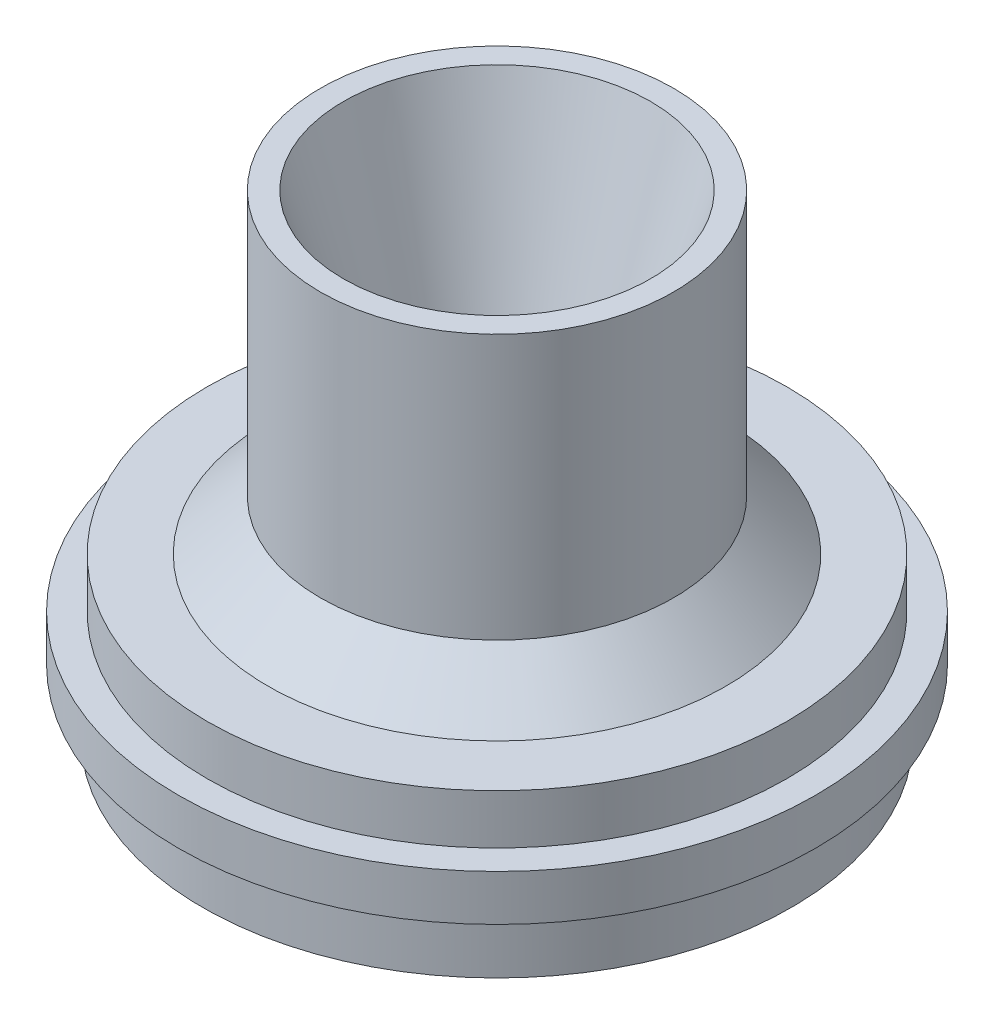
ISO-10303-21;
HEADER;
FILE_DESCRIPTION(('STEP AP214'),'2;1');
FILE_NAME('part.step','',(''),(''),'','','');
FILE_SCHEMA(('AUTOMOTIVE_DESIGN { 1 0 10303 214 1 1 1 1 }'));
ENDSEC;
DATA;
#1=APPLICATION_CONTEXT('core data for automotive mechanical design processes');
#2=APPLICATION_PROTOCOL_DEFINITION('international standard','automotive_design',2000,#1);
#3=PRODUCT_CONTEXT('',#1,'mechanical');
#4=PRODUCT('Part','Part','',(#3));
#5=PRODUCT_RELATED_PRODUCT_CATEGORY('part','',(#4));
#6=PRODUCT_DEFINITION_FORMATION('','',#4);
#7=PRODUCT_DEFINITION_CONTEXT('part definition',#1,'design');
#8=PRODUCT_DEFINITION('design','',#6,#7);
#9=PRODUCT_DEFINITION_SHAPE('','',#8);
#10=(LENGTH_UNIT() NAMED_UNIT(*) SI_UNIT(.MILLI.,.METRE.));
#11=(NAMED_UNIT(*) PLANE_ANGLE_UNIT() SI_UNIT($,.RADIAN.));
#12=(NAMED_UNIT(*) SI_UNIT($,.STERADIAN.) SOLID_ANGLE_UNIT());
#13=UNCERTAINTY_MEASURE_WITH_UNIT(LENGTH_MEASURE(1.E-05),#10,'distance_accuracy_value','');
#14=(GEOMETRIC_REPRESENTATION_CONTEXT(3) GLOBAL_UNCERTAINTY_ASSIGNED_CONTEXT((#13)) GLOBAL_UNIT_ASSIGNED_CONTEXT((#10,
#11,#12)) REPRESENTATION_CONTEXT('',''));
#15=CARTESIAN_POINT('',(0.,0.,0.));
#16=DIRECTION('',(0.,0.,1.));
#17=DIRECTION('',(1.,0.,0.));
#18=AXIS2_PLACEMENT_3D('',#15,#16,#17);
#19=CARTESIAN_POINT('',(0.,0.,0.));
#20=DIRECTION('',(0.,-1.,0.));
#21=DIRECTION('',(0.,0.,-1.));
#22=AXIS2_PLACEMENT_3D('',#19,#20,#21);
#23=CYLINDRICAL_SURFACE('',#22,42.3185589062585);
#24=CARTESIAN_POINT('',(0.,-42.8244,0.));
#25=DIRECTION('',(0.,-1.,0.));
#26=DIRECTION('',(0.,0.,-1.));
#27=AXIS2_PLACEMENT_3D('',#24,#25,#26);
#28=CIRCLE('',#27,42.3185589062585);
#29=CARTESIAN_POINT('',(0.,-42.8244,-42.3185589062585));
#30=VERTEX_POINT('',#29);
#31=EDGE_CURVE('E10',#30,#30,#28,.T.);
#32=ORIENTED_EDGE('',*,*,#31,.F.);
#33=EDGE_LOOP('',(#32));
#34=FACE_BOUND('',#33,.T.);
#35=CARTESIAN_POINT('',(0.,-33.6804,0.));
#36=DIRECTION('',(0.,-1.,0.));
#37=DIRECTION('',(0.,0.,-1.));
#38=AXIS2_PLACEMENT_3D('',#35,#36,#37);
#39=CIRCLE('',#38,42.3185589062585);
#40=CARTESIAN_POINT('',(0.,-33.6804,-42.3185589062585));
#41=VERTEX_POINT('',#40);
#42=EDGE_CURVE('E73',#41,#41,#39,.T.);
#43=ORIENTED_EDGE('',*,*,#42,.T.);
#44=EDGE_LOOP('',(#43));
#45=FACE_BOUND('',#44,.T.);
#46=ADVANCED_FACE('F30',(#34,#45),#23,.T.);
#47=CARTESIAN_POINT('',(-35.0647,-42.8244,0.));
#48=DIRECTION('',(0.,1.,0.));
#49=DIRECTION('',(0.,0.,1.));
#50=AXIS2_PLACEMENT_3D('',#47,#48,#49);
#51=PLANE('',#50);
#52=CARTESIAN_POINT('',(0.,-42.8244,0.));
#53=DIRECTION('',(0.,-1.,0.));
#54=DIRECTION('',(0.,0.,-1.));
#55=AXIS2_PLACEMENT_3D('',#52,#53,#54);
#56=CIRCLE('',#55,35.0647);
#57=CARTESIAN_POINT('',(0.,-42.8244,-35.0647));
#58=VERTEX_POINT('',#57);
#59=EDGE_CURVE('E36',#58,#58,#56,.T.);
#60=ORIENTED_EDGE('',*,*,#59,.F.);
#61=EDGE_LOOP('',(#60));
#62=FACE_BOUND('',#61,.T.);
#63=ORIENTED_EDGE('',*,*,#31,.T.);
#64=EDGE_LOOP('',(#63));
#65=FACE_BOUND('',#64,.T.);
#66=ADVANCED_FACE('F140',(#62,#65),#51,.F.);
#67=CARTESIAN_POINT('',(0.,-42.8244,0.));
#68=DIRECTION('',(0.,-1.,0.));
#69=DIRECTION('',(0.,0.,-1.));
#70=AXIS2_PLACEMENT_3D('',#67,#68,#69);
#71=CONICAL_SURFACE('',#70,35.0647,1.06615947241983);
#72=CARTESIAN_POINT('',(0.,-30.226,0.));
#73=DIRECTION('',(0.,-1.,0.));
#74=DIRECTION('',(0.,0.,-1.));
#75=AXIS2_PLACEMENT_3D('',#72,#73,#74);
#76=CIRCLE('',#75,12.2555);
#77=CARTESIAN_POINT('',(0.,-30.226,-12.2555));
#78=VERTEX_POINT('',#77);
#79=EDGE_CURVE('E40',#78,#78,#76,.T.);
#80=ORIENTED_EDGE('',*,*,#79,.F.);
#81=EDGE_LOOP('',(#80));
#82=FACE_BOUND('',#81,.T.);
#83=ORIENTED_EDGE('',*,*,#59,.T.);
#84=EDGE_LOOP('',(#83));
#85=FACE_BOUND('',#84,.T.);
#86=ADVANCED_FACE('F135',(#82,#85),#71,.F.);
#87=CARTESIAN_POINT('',(0.,0.,0.));
#88=DIRECTION('',(0.,-1.,0.));
#89=DIRECTION('',(0.,0.,-1.));
#90=AXIS2_PLACEMENT_3D('',#87,#88,#89);
#91=CYLINDRICAL_SURFACE('',#90,12.2555);
#92=CARTESIAN_POINT('',(0.,-7.366,0.));
#93=DIRECTION('',(0.,-1.,0.));
#94=DIRECTION('',(0.,0.,-1.));
#95=AXIS2_PLACEMENT_3D('',#92,#93,#94);
#96=CIRCLE('',#95,12.2555);
#97=CARTESIAN_POINT('',(0.,-7.366,-12.2555));
#98=VERTEX_POINT('',#97);
#99=EDGE_CURVE('E44',#98,#98,#96,.T.);
#100=ORIENTED_EDGE('',*,*,#99,.F.);
#101=EDGE_LOOP('',(#100));
#102=FACE_BOUND('',#101,.T.);
#103=ORIENTED_EDGE('',*,*,#79,.T.);
#104=EDGE_LOOP('',(#103));
#105=FACE_BOUND('',#104,.T.);
#106=ADVANCED_FACE('F129',(#102,#105),#91,.F.);
#107=CARTESIAN_POINT('',(0.,-7.366,0.));
#108=DIRECTION('',(0.,1.,0.));
#109=DIRECTION('',(0.,0.,1.));
#110=AXIS2_PLACEMENT_3D('',#107,#108,#109);
#111=CONICAL_SURFACE('',#110,12.2555,0.29181235001844);
#112=CARTESIAN_POINT('',(0.,25.4,0.));
#113=DIRECTION('',(0.,-1.,0.));
#114=DIRECTION('',(0.,0.,-1.));
#115=AXIS2_PLACEMENT_3D('',#112,#113,#114);
#116=CIRCLE('',#115,22.098);
#117=CARTESIAN_POINT('',(0.,25.4,-22.098));
#118=VERTEX_POINT('',#117);
#119=EDGE_CURVE('E49',#118,#118,#116,.T.);
#120=ORIENTED_EDGE('',*,*,#119,.F.);
#121=EDGE_LOOP('',(#120));
#122=FACE_BOUND('',#121,.T.);
#123=ORIENTED_EDGE('',*,*,#99,.T.);
#124=EDGE_LOOP('',(#123));
#125=FACE_BOUND('',#124,.T.);
#126=ADVANCED_FACE('F123',(#122,#125),#111,.F.);
#127=CARTESIAN_POINT('',(-25.4,25.4,0.));
#128=DIRECTION('',(0.,-1.,0.));
#129=DIRECTION('',(0.,0.,-1.));
#130=AXIS2_PLACEMENT_3D('',#127,#128,#129);
#131=PLANE('',#130);
#132=CARTESIAN_POINT('',(0.,25.4,0.));
#133=DIRECTION('',(0.,-1.,0.));
#134=DIRECTION('',(0.,0.,-1.));
#135=AXIS2_PLACEMENT_3D('',#132,#133,#134);
#136=CIRCLE('',#135,25.4);
#137=CARTESIAN_POINT('',(0.,25.4,-25.4));
#138=VERTEX_POINT('',#137);
#139=EDGE_CURVE('E52',#138,#138,#136,.T.);
#140=ORIENTED_EDGE('',*,*,#139,.F.);
#141=EDGE_LOOP('',(#140));
#142=FACE_BOUND('',#141,.T.);
#143=ORIENTED_EDGE('',*,*,#119,.T.);
#144=EDGE_LOOP('',(#143));
#145=FACE_BOUND('',#144,.T.);
#146=ADVANCED_FACE('F117',(#142,#145),#131,.F.);
#147=CARTESIAN_POINT('',(0.,0.,0.));
#148=DIRECTION('',(0.,-1.,0.));
#149=DIRECTION('',(0.,0.,-1.));
#150=AXIS2_PLACEMENT_3D('',#147,#148,#149);
#151=CYLINDRICAL_SURFACE('',#150,25.4);
#152=CARTESIAN_POINT('',(0.,-12.7,0.));
#153=DIRECTION('',(0.,-1.,0.));
#154=DIRECTION('',(0.,0.,-1.));
#155=AXIS2_PLACEMENT_3D('',#152,#153,#154);
#156=CIRCLE('',#155,25.4);
#157=CARTESIAN_POINT('',(0.,-12.7,-25.4));
#158=VERTEX_POINT('',#157);
#159=EDGE_CURVE('E55',#158,#158,#156,.T.);
#160=ORIENTED_EDGE('',*,*,#159,.F.);
#161=EDGE_LOOP('',(#160));
#162=FACE_BOUND('',#161,.T.);
#163=ORIENTED_EDGE('',*,*,#139,.T.);
#164=EDGE_LOOP('',(#163));
#165=FACE_BOUND('',#164,.T.);
#166=ADVANCED_FACE('F111',(#162,#165),#151,.T.);
#167=CARTESIAN_POINT('',(0.,-12.7,0.));
#168=DIRECTION('',(0.,-1.,0.));
#169=DIRECTION('',(0.,0.,-1.));
#170=AXIS2_PLACEMENT_3D('',#167,#168,#169);
#171=CONICAL_SURFACE('',#170,25.4,0.805172026004439);
#172=CARTESIAN_POINT('',(0.,-19.939,0.));
#173=DIRECTION('',(0.,-1.,0.));
#174=DIRECTION('',(0.,0.,-1.));
#175=AXIS2_PLACEMENT_3D('',#172,#173,#174);
#176=CIRCLE('',#175,32.9311);
#177=CARTESIAN_POINT('',(0.,-19.939,-32.9311));
#178=VERTEX_POINT('',#177);
#179=EDGE_CURVE('E58',#178,#178,#176,.T.);
#180=ORIENTED_EDGE('',*,*,#179,.F.);
#181=EDGE_LOOP('',(#180));
#182=FACE_BOUND('',#181,.T.);
#183=ORIENTED_EDGE('',*,*,#159,.T.);
#184=EDGE_LOOP('',(#183));
#185=FACE_BOUND('',#184,.T.);
#186=ADVANCED_FACE('F105',(#182,#185),#171,.T.);
#187=CARTESIAN_POINT('',(-41.6941,-19.939,0.));
#188=DIRECTION('',(0.,-1.,0.));
#189=DIRECTION('',(0.,0.,-1.));
#190=AXIS2_PLACEMENT_3D('',#187,#188,#189);
#191=PLANE('',#190);
#192=CARTESIAN_POINT('',(0.,-19.939,0.));
#193=DIRECTION('',(0.,-1.,0.));
#194=DIRECTION('',(0.,0.,-1.));
#195=AXIS2_PLACEMENT_3D('',#192,#193,#194);
#196=CIRCLE('',#195,41.6941);
#197=CARTESIAN_POINT('',(0.,-19.939,-41.6941));
#198=VERTEX_POINT('',#197);
#199=EDGE_CURVE('E61',#198,#198,#196,.T.);
#200=ORIENTED_EDGE('',*,*,#199,.F.);
#201=EDGE_LOOP('',(#200));
#202=FACE_BOUND('',#201,.T.);
#203=ORIENTED_EDGE('',*,*,#179,.T.);
#204=EDGE_LOOP('',(#203));
#205=FACE_BOUND('',#204,.T.);
#206=ADVANCED_FACE('F99',(#202,#205),#191,.F.);
#207=CARTESIAN_POINT('',(0.,0.,0.));
#208=DIRECTION('',(0.,-1.,0.));
#209=DIRECTION('',(0.,0.,-1.));
#210=AXIS2_PLACEMENT_3D('',#207,#208,#209);
#211=CYLINDRICAL_SURFACE('',#210,41.6941);
#212=CARTESIAN_POINT('',(0.,-27.0764,0.));
#213=DIRECTION('',(0.,-1.,0.));
#214=DIRECTION('',(0.,0.,-1.));
#215=AXIS2_PLACEMENT_3D('',#212,#213,#214);
#216=CIRCLE('',#215,41.6941);
#217=CARTESIAN_POINT('',(0.,-27.0764,-41.6941));
#218=VERTEX_POINT('',#217);
#219=EDGE_CURVE('E64',#218,#218,#216,.T.);
#220=ORIENTED_EDGE('',*,*,#219,.F.);
#221=EDGE_LOOP('',(#220));
#222=FACE_BOUND('',#221,.T.);
#223=ORIENTED_EDGE('',*,*,#199,.T.);
#224=EDGE_LOOP('',(#223));
#225=FACE_BOUND('',#224,.T.);
#226=ADVANCED_FACE('F93',(#222,#225),#211,.T.);
#227=CARTESIAN_POINT('',(-45.8216,-27.0764,0.));
#228=DIRECTION('',(0.,-1.,0.));
#229=DIRECTION('',(0.,0.,-1.));
#230=AXIS2_PLACEMENT_3D('',#227,#228,#229);
#231=PLANE('',#230);
#232=CARTESIAN_POINT('',(0.,-27.0764,0.));
#233=DIRECTION('',(0.,-1.,0.));
#234=DIRECTION('',(0.,0.,-1.));
#235=AXIS2_PLACEMENT_3D('',#232,#233,#234);
#236=CIRCLE('',#235,45.8216);
#237=CARTESIAN_POINT('',(0.,-27.0764,-45.8216));
#238=VERTEX_POINT('',#237);
#239=EDGE_CURVE('E67',#238,#238,#236,.T.);
#240=ORIENTED_EDGE('',*,*,#239,.F.);
#241=EDGE_LOOP('',(#240));
#242=FACE_BOUND('',#241,.T.);
#243=ORIENTED_EDGE('',*,*,#219,.T.);
#244=EDGE_LOOP('',(#243));
#245=FACE_BOUND('',#244,.T.);
#246=ADVANCED_FACE('F87',(#242,#245),#231,.F.);
#247=CARTESIAN_POINT('',(0.,0.,0.));
#248=DIRECTION('',(0.,-1.,0.));
#249=DIRECTION('',(0.,0.,-1.));
#250=AXIS2_PLACEMENT_3D('',#247,#248,#249);
#251=CYLINDRICAL_SURFACE('',#250,45.8216);
#252=CARTESIAN_POINT('',(0.,-33.6804,0.));
#253=DIRECTION('',(0.,-1.,0.));
#254=DIRECTION('',(0.,0.,-1.));
#255=AXIS2_PLACEMENT_3D('',#252,#253,#254);
#256=CIRCLE('',#255,45.8216);
#257=CARTESIAN_POINT('',(0.,-33.6804,-45.8216));
#258=VERTEX_POINT('',#257);
#259=EDGE_CURVE('E70',#258,#258,#256,.T.);
#260=ORIENTED_EDGE('',*,*,#259,.F.);
#261=EDGE_LOOP('',(#260));
#262=FACE_BOUND('',#261,.T.);
#263=ORIENTED_EDGE('',*,*,#239,.T.);
#264=EDGE_LOOP('',(#263));
#265=FACE_BOUND('',#264,.T.);
#266=ADVANCED_FACE('F81',(#262,#265),#251,.T.);
#267=CARTESIAN_POINT('',(-42.3185589062585,-33.6804,0.));
#268=DIRECTION('',(0.,1.,0.));
#269=DIRECTION('',(0.,0.,1.));
#270=AXIS2_PLACEMENT_3D('',#267,#268,#269);
#271=PLANE('',#270);
#272=ORIENTED_EDGE('',*,*,#42,.F.);
#273=EDGE_LOOP('',(#272));
#274=FACE_BOUND('',#273,.T.);
#275=ORIENTED_EDGE('',*,*,#259,.T.);
#276=EDGE_LOOP('',(#275));
#277=FACE_BOUND('',#276,.T.);
#278=ADVANCED_FACE('F78',(#274,#277),#271,.F.);
#279=CLOSED_SHELL('',(#46,#66,#86,#106,#126,#146,#166,#186,#206,#226,#246,#266,#278));
#280=MANIFOLD_SOLID_BREP('B2',#279);
#281=ADVANCED_BREP_SHAPE_REPRESENTATION('',(#18,#280),#14);
#282=SHAPE_DEFINITION_REPRESENTATION(#9,#281);
ENDSEC;
END-ISO-10303-21;
